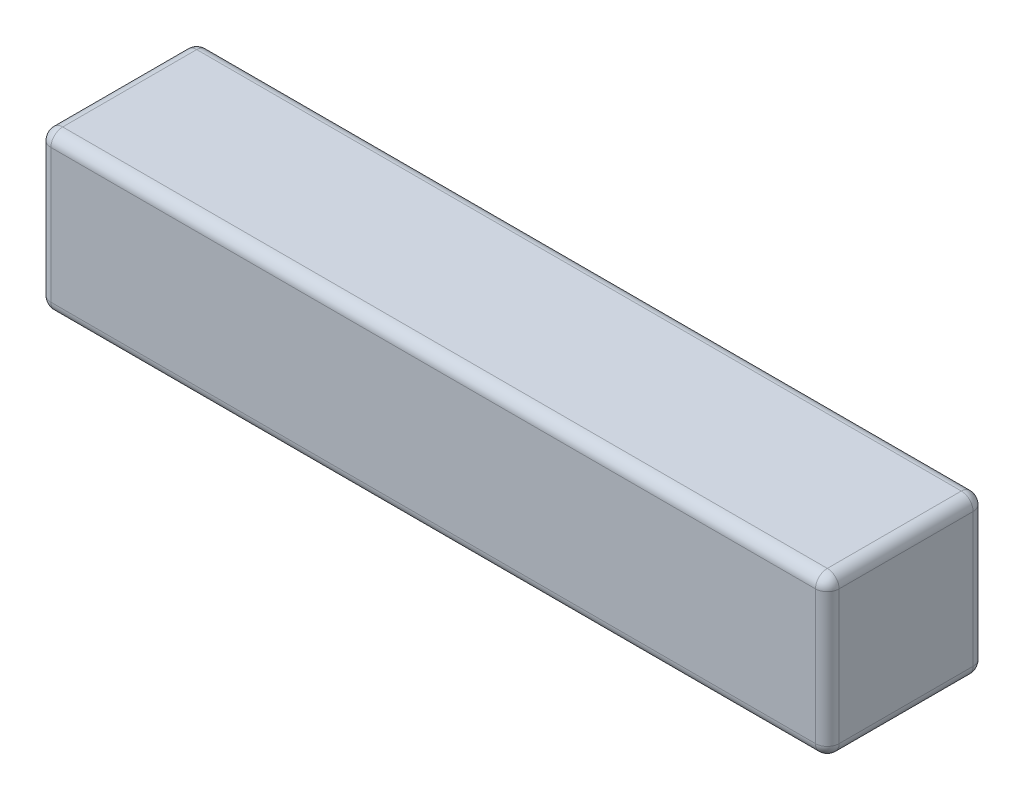
ISO-10303-21;
HEADER;
FILE_DESCRIPTION(('STEP AP214'),'2;1');
FILE_NAME('part.step','',(''),(''),'','','');
FILE_SCHEMA(('AUTOMOTIVE_DESIGN { 1 0 10303 214 1 1 1 1 }'));
ENDSEC;
DATA;
#1=APPLICATION_CONTEXT('core data for automotive mechanical design processes');
#2=APPLICATION_PROTOCOL_DEFINITION('international standard','automotive_design',2000,#1);
#3=PRODUCT_CONTEXT('',#1,'mechanical');
#4=PRODUCT('Part','Part','',(#3));
#5=PRODUCT_RELATED_PRODUCT_CATEGORY('part','',(#4));
#6=PRODUCT_DEFINITION_FORMATION('','',#4);
#7=PRODUCT_DEFINITION_CONTEXT('part definition',#1,'design');
#8=PRODUCT_DEFINITION('design','',#6,#7);
#9=PRODUCT_DEFINITION_SHAPE('','',#8);
#10=(LENGTH_UNIT() NAMED_UNIT(*) SI_UNIT(.MILLI.,.METRE.));
#11=(NAMED_UNIT(*) PLANE_ANGLE_UNIT() SI_UNIT($,.RADIAN.));
#12=(NAMED_UNIT(*) SI_UNIT($,.STERADIAN.) SOLID_ANGLE_UNIT());
#13=UNCERTAINTY_MEASURE_WITH_UNIT(LENGTH_MEASURE(1.E-05),#10,'distance_accuracy_value','');
#14=(GEOMETRIC_REPRESENTATION_CONTEXT(3) GLOBAL_UNCERTAINTY_ASSIGNED_CONTEXT((#13)) GLOBAL_UNIT_ASSIGNED_CONTEXT((#10,
#11,#12)) REPRESENTATION_CONTEXT('',''));
#15=CARTESIAN_POINT('',(0.,0.,0.));
#16=DIRECTION('',(0.,0.,1.));
#17=DIRECTION('',(1.,0.,0.));
#18=AXIS2_PLACEMENT_3D('',#15,#16,#17);
#19=CARTESIAN_POINT('',(4.,-0.15,-3.25423963133641));
#20=DIRECTION('',(-1.,0.,0.));
#21=DIRECTION('',(0.,0.,1.));
#22=AXIS2_PLACEMENT_3D('',#19,#20,#21);
#23=CYLINDRICAL_SURFACE('',#22,0.15);
#24=CARTESIAN_POINT('',(13.85,-0.15,-3.25423963133641));
#25=DIRECTION('',(-1.,0.,0.));
#26=DIRECTION('',(0.,0.,-1.));
#27=AXIS2_PLACEMENT_3D('',#24,#25,#26);
#28=CIRCLE('',#27,0.15);
#29=CARTESIAN_POINT('',(13.85,0.,-3.25423963133641));
#30=VERTEX_POINT('',#29);
#31=CARTESIAN_POINT('',(13.85,-0.15,-3.4042396313364));
#32=VERTEX_POINT('',#31);
#33=EDGE_CURVE('E25',#30,#32,#28,.T.);
#34=ORIENTED_EDGE('',*,*,#33,.T.);
#35=DIRECTION('',(1.,0.,0.));
#36=VECTOR('',#35,1.);
#37=CARTESIAN_POINT('',(14.,-0.15,-3.4042396313364));
#38=LINE('',#37,#36);
#39=CARTESIAN_POINT('',(4.15,-0.15,-3.4042396313364));
#40=VERTEX_POINT('',#39);
#41=EDGE_CURVE('E200',#40,#32,#38,.T.);
#42=ORIENTED_EDGE('',*,*,#41,.F.);
#43=CARTESIAN_POINT('',(4.15,-0.15,-3.25423963133641));
#44=DIRECTION('',(1.,0.,0.));
#45=DIRECTION('',(0.,0.,1.));
#46=AXIS2_PLACEMENT_3D('',#43,#44,#45);
#47=CIRCLE('',#46,0.15);
#48=CARTESIAN_POINT('',(4.15,0.,-3.25423963133641));
#49=VERTEX_POINT('',#48);
#50=EDGE_CURVE('E11',#40,#49,#47,.T.);
#51=ORIENTED_EDGE('',*,*,#50,.T.);
#52=DIRECTION('',(-1.,0.,0.));
#53=VECTOR('',#52,1.);
#54=CARTESIAN_POINT('',(4.,0.,-3.25423963133641));
#55=LINE('',#54,#53);
#56=EDGE_CURVE('E257',#30,#49,#55,.T.);
#57=ORIENTED_EDGE('',*,*,#56,.F.);
#58=EDGE_LOOP('',(#34,#42,#51,#57));
#59=FACE_BOUND('',#58,.T.);
#60=ADVANCED_FACE('F16',(#59),#23,.T.);
#61=CARTESIAN_POINT('',(4.15,-0.15,-3.25423963133641));
#62=DIRECTION('',(0.,1.,0.));
#63=DIRECTION('',(1.,0.,0.));
#64=AXIS2_PLACEMENT_3D('',#61,#62,#63);
#65=SPHERICAL_SURFACE('',#64,0.15);
#66=CARTESIAN_POINT('',(4.15,-0.15,-3.25423963133641));
#67=DIRECTION('',(0.,1.,0.));
#68=DIRECTION('',(0.,0.,1.));
#69=AXIS2_PLACEMENT_3D('',#66,#67,#68);
#70=CIRCLE('',#69,0.15);
#71=CARTESIAN_POINT('',(4.,-0.15,-3.25423963133641));
#72=VERTEX_POINT('',#71);
#73=EDGE_CURVE('E224',#40,#72,#70,.T.);
#74=ORIENTED_EDGE('',*,*,#73,.T.);
#75=CARTESIAN_POINT('',(4.15,-0.15,-3.25423963133641));
#76=DIRECTION('',(0.,0.,-1.));
#77=DIRECTION('',(-1.,0.,0.));
#78=AXIS2_PLACEMENT_3D('',#75,#76,#77);
#79=CIRCLE('',#78,0.15);
#80=EDGE_CURVE('E174',#72,#49,#79,.T.);
#81=ORIENTED_EDGE('',*,*,#80,.T.);
#82=ORIENTED_EDGE('',*,*,#50,.F.);
#83=EDGE_LOOP('',(#74,#81,#82));
#84=FACE_BOUND('',#83,.T.);
#85=ADVANCED_FACE('F18',(#84),#65,.T.);
#86=CARTESIAN_POINT('',(13.85,-0.15,-3.25423963133641));
#87=DIRECTION('',(0.,1.,0.));
#88=DIRECTION('',(1.,0.,0.));
#89=AXIS2_PLACEMENT_3D('',#86,#87,#88);
#90=SPHERICAL_SURFACE('',#89,0.15);
#91=CARTESIAN_POINT('',(13.85,-0.15,-3.25423963133641));
#92=DIRECTION('',(0.,0.,-1.));
#93=DIRECTION('',(-1.,0.,0.));
#94=AXIS2_PLACEMENT_3D('',#91,#92,#93);
#95=CIRCLE('',#94,0.15);
#96=CARTESIAN_POINT('',(14.,-0.15,-3.25423963133641));
#97=VERTEX_POINT('',#96);
#98=EDGE_CURVE('E194',#30,#97,#95,.T.);
#99=ORIENTED_EDGE('',*,*,#98,.T.);
#100=CARTESIAN_POINT('',(13.85,-0.15,-3.25423963133641));
#101=DIRECTION('',(0.,1.,0.));
#102=DIRECTION('',(0.,0.,1.));
#103=AXIS2_PLACEMENT_3D('',#100,#101,#102);
#104=CIRCLE('',#103,0.15);
#105=EDGE_CURVE('E189',#97,#32,#104,.T.);
#106=ORIENTED_EDGE('',*,*,#105,.T.);
#107=ORIENTED_EDGE('',*,*,#33,.F.);
#108=EDGE_LOOP('',(#99,#106,#107));
#109=FACE_BOUND('',#108,.T.);
#110=ADVANCED_FACE('F332',(#109),#90,.T.);
#111=CARTESIAN_POINT('',(4.15,-2.,-3.25423963133641));
#112=DIRECTION('',(0.,1.,0.));
#113=DIRECTION('',(0.,0.,1.));
#114=AXIS2_PLACEMENT_3D('',#111,#112,#113);
#115=CYLINDRICAL_SURFACE('',#114,0.15);
#116=CARTESIAN_POINT('',(4.15,-1.85,-3.25423963133641));
#117=DIRECTION('',(0.,1.,0.));
#118=DIRECTION('',(0.,0.,-1.));
#119=AXIS2_PLACEMENT_3D('',#116,#117,#118);
#120=CIRCLE('',#119,0.15);
#121=CARTESIAN_POINT('',(4.15,-1.85,-3.4042396313364));
#122=VERTEX_POINT('',#121);
#123=CARTESIAN_POINT('',(4.,-1.85,-3.25423963133641));
#124=VERTEX_POINT('',#123);
#125=EDGE_CURVE('E145',#122,#124,#120,.T.);
#126=ORIENTED_EDGE('',*,*,#125,.T.);
#127=DIRECTION('',(0.,-1.,0.));
#128=VECTOR('',#127,1.);
#129=CARTESIAN_POINT('',(4.,-2.,-3.25423963133641));
#130=LINE('',#129,#128);
#131=EDGE_CURVE('E176',#72,#124,#130,.T.);
#132=ORIENTED_EDGE('',*,*,#131,.F.);
#133=ORIENTED_EDGE('',*,*,#73,.F.);
#134=DIRECTION('',(0.,1.,0.));
#135=VECTOR('',#134,1.);
#136=CARTESIAN_POINT('',(4.15,-2.,-3.4042396313364));
#137=LINE('',#136,#135);
#138=EDGE_CURVE('E193',#122,#40,#137,.T.);
#139=ORIENTED_EDGE('',*,*,#138,.F.);
#140=EDGE_LOOP('',(#126,#132,#133,#139));
#141=FACE_BOUND('',#140,.T.);
#142=ADVANCED_FACE('F345',(#141),#115,.T.);
#143=CARTESIAN_POINT('',(4.15,-0.15,-1.4042396313364));
#144=DIRECTION('',(0.,0.,1.));
#145=DIRECTION('',(1.,0.,0.));
#146=AXIS2_PLACEMENT_3D('',#143,#144,#145);
#147=CYLINDRICAL_SURFACE('',#146,0.15);
#148=CARTESIAN_POINT('',(4.15,-0.15,-1.5542396313364));
#149=DIRECTION('',(0.,0.,-1.));
#150=DIRECTION('',(1.,0.,0.));
#151=AXIS2_PLACEMENT_3D('',#148,#149,#150);
#152=CIRCLE('',#151,0.15);
#153=CARTESIAN_POINT('',(4.,-0.15,-1.5542396313364));
#154=VERTEX_POINT('',#153);
#155=CARTESIAN_POINT('',(4.15,0.,-1.5542396313364));
#156=VERTEX_POINT('',#155);
#157=EDGE_CURVE('E36',#154,#156,#152,.T.);
#158=ORIENTED_EDGE('',*,*,#157,.T.);
#159=DIRECTION('',(0.,0.,1.));
#160=VECTOR('',#159,1.);
#161=CARTESIAN_POINT('',(4.15,0.,-1.4042396313364));
#162=LINE('',#161,#160);
#163=EDGE_CURVE('E262',#49,#156,#162,.T.);
#164=ORIENTED_EDGE('',*,*,#163,.F.);
#165=ORIENTED_EDGE('',*,*,#80,.F.);
#166=DIRECTION('',(0.,0.,-1.));
#167=VECTOR('',#166,1.);
#168=CARTESIAN_POINT('',(4.,-0.15,-3.4042396313364));
#169=LINE('',#168,#167);
#170=EDGE_CURVE('E164',#154,#72,#169,.T.);
#171=ORIENTED_EDGE('',*,*,#170,.F.);
#172=EDGE_LOOP('',(#158,#164,#165,#171));
#173=FACE_BOUND('',#172,.T.);
#174=ADVANCED_FACE('F172',(#173),#147,.T.);
#175=CARTESIAN_POINT('',(13.85,-0.15,-1.4042396313364));
#176=DIRECTION('',(0.,0.,-1.));
#177=DIRECTION('',(-1.,0.,0.));
#178=AXIS2_PLACEMENT_3D('',#175,#176,#177);
#179=CYLINDRICAL_SURFACE('',#178,0.15);
#180=CARTESIAN_POINT('',(13.85,-0.15,-1.5542396313364));
#181=DIRECTION('',(0.,0.,-1.));
#182=DIRECTION('',(1.,0.,0.));
#183=AXIS2_PLACEMENT_3D('',#180,#181,#182);
#184=CIRCLE('',#183,0.15);
#185=CARTESIAN_POINT('',(13.85,0.,-1.5542396313364));
#186=VERTEX_POINT('',#185);
#187=CARTESIAN_POINT('',(14.,-0.15,-1.5542396313364));
#188=VERTEX_POINT('',#187);
#189=EDGE_CURVE('E144',#186,#188,#184,.T.);
#190=ORIENTED_EDGE('',*,*,#189,.T.);
#191=DIRECTION('',(0.,0.,1.));
#192=VECTOR('',#191,1.);
#193=CARTESIAN_POINT('',(14.,-0.15,-1.4042396313364));
#194=LINE('',#193,#192);
#195=EDGE_CURVE('E187',#97,#188,#194,.T.);
#196=ORIENTED_EDGE('',*,*,#195,.F.);
#197=ORIENTED_EDGE('',*,*,#98,.F.);
#198=DIRECTION('',(0.,0.,-1.));
#199=VECTOR('',#198,1.);
#200=CARTESIAN_POINT('',(13.85,0.,-1.4042396313364));
#201=LINE('',#200,#199);
#202=EDGE_CURVE('E258',#186,#30,#201,.T.);
#203=ORIENTED_EDGE('',*,*,#202,.F.);
#204=EDGE_LOOP('',(#190,#196,#197,#203));
#205=FACE_BOUND('',#204,.T.);
#206=ADVANCED_FACE('F348',(#205),#179,.T.);
#207=CARTESIAN_POINT('',(13.85,-2.,-3.25423963133641));
#208=DIRECTION('',(0.,1.,0.));
#209=DIRECTION('',(0.,0.,1.));
#210=AXIS2_PLACEMENT_3D('',#207,#208,#209);
#211=CYLINDRICAL_SURFACE('',#210,0.15);
#212=CARTESIAN_POINT('',(13.85,-1.85,-3.25423963133641));
#213=DIRECTION('',(0.,1.,0.));
#214=DIRECTION('',(0.,0.,-1.));
#215=AXIS2_PLACEMENT_3D('',#212,#213,#214);
#216=CIRCLE('',#215,0.15);
#217=CARTESIAN_POINT('',(14.,-1.85,-3.25423963133641));
#218=VERTEX_POINT('',#217);
#219=CARTESIAN_POINT('',(13.85,-1.85,-3.4042396313364));
#220=VERTEX_POINT('',#219);
#221=EDGE_CURVE('E318',#218,#220,#216,.T.);
#222=ORIENTED_EDGE('',*,*,#221,.T.);
#223=DIRECTION('',(0.,-1.,0.));
#224=VECTOR('',#223,1.);
#225=CARTESIAN_POINT('',(13.85,-2.,-3.4042396313364));
#226=LINE('',#225,#224);
#227=EDGE_CURVE('E206',#32,#220,#226,.T.);
#228=ORIENTED_EDGE('',*,*,#227,.F.);
#229=ORIENTED_EDGE('',*,*,#105,.F.);
#230=DIRECTION('',(0.,1.,0.));
#231=VECTOR('',#230,1.);
#232=CARTESIAN_POINT('',(14.,-2.,-3.25423963133641));
#233=LINE('',#232,#231);
#234=EDGE_CURVE('E182',#218,#97,#233,.T.);
#235=ORIENTED_EDGE('',*,*,#234,.F.);
#236=EDGE_LOOP('',(#222,#228,#229,#235));
#237=FACE_BOUND('',#236,.T.);
#238=ADVANCED_FACE('F333',(#237),#211,.T.);
#239=CARTESIAN_POINT('',(4.15,-1.85,-3.25423963133641));
#240=DIRECTION('',(0.,1.,0.));
#241=DIRECTION('',(1.,0.,0.));
#242=AXIS2_PLACEMENT_3D('',#239,#240,#241);
#243=SPHERICAL_SURFACE('',#242,0.15);
#244=CARTESIAN_POINT('',(4.15,-1.85,-3.25423963133641));
#245=DIRECTION('',(-1.,0.,0.));
#246=DIRECTION('',(0.,-1.,0.));
#247=AXIS2_PLACEMENT_3D('',#244,#245,#246);
#248=CIRCLE('',#247,0.15);
#249=CARTESIAN_POINT('',(4.15,-2.,-3.25423963133641));
#250=VERTEX_POINT('',#249);
#251=EDGE_CURVE('E312',#122,#250,#248,.T.);
#252=ORIENTED_EDGE('',*,*,#251,.T.);
#253=CARTESIAN_POINT('',(4.15,-1.85,-3.25423963133641));
#254=DIRECTION('',(0.,0.,-1.));
#255=DIRECTION('',(-1.,0.,0.));
#256=AXIS2_PLACEMENT_3D('',#253,#254,#255);
#257=CIRCLE('',#256,0.15);
#258=EDGE_CURVE('E158',#250,#124,#257,.T.);
#259=ORIENTED_EDGE('',*,*,#258,.T.);
#260=ORIENTED_EDGE('',*,*,#125,.F.);
#261=EDGE_LOOP('',(#252,#259,#260));
#262=FACE_BOUND('',#261,.T.);
#263=ADVANCED_FACE('F364',(#262),#243,.T.);
#264=CARTESIAN_POINT('',(4.15,-0.15,-1.5542396313364));
#265=DIRECTION('',(0.,1.,0.));
#266=DIRECTION('',(1.,0.,0.));
#267=AXIS2_PLACEMENT_3D('',#264,#265,#266);
#268=SPHERICAL_SURFACE('',#267,0.15);
#269=CARTESIAN_POINT('',(4.15,-0.15,-1.5542396313364));
#270=DIRECTION('',(0.,1.,0.));
#271=DIRECTION('',(0.,0.,1.));
#272=AXIS2_PLACEMENT_3D('',#269,#270,#271);
#273=CIRCLE('',#272,0.15);
#274=CARTESIAN_POINT('',(4.15,-0.15,-1.4042396313364));
#275=VERTEX_POINT('',#274);
#276=EDGE_CURVE('E136',#154,#275,#273,.T.);
#277=ORIENTED_EDGE('',*,*,#276,.T.);
#278=CARTESIAN_POINT('',(4.15,-0.15,-1.5542396313364));
#279=DIRECTION('',(-1.,0.,0.));
#280=DIRECTION('',(0.,0.,1.));
#281=AXIS2_PLACEMENT_3D('',#278,#279,#280);
#282=CIRCLE('',#281,0.15);
#283=EDGE_CURVE('E143',#275,#156,#282,.T.);
#284=ORIENTED_EDGE('',*,*,#283,.T.);
#285=ORIENTED_EDGE('',*,*,#157,.F.);
#286=EDGE_LOOP('',(#277,#284,#285));
#287=FACE_BOUND('',#286,.T.);
#288=ADVANCED_FACE('F139',(#287),#268,.T.);
#289=CARTESIAN_POINT('',(13.85,-0.15,-1.5542396313364));
#290=DIRECTION('',(0.,1.,0.));
#291=DIRECTION('',(1.,0.,0.));
#292=AXIS2_PLACEMENT_3D('',#289,#290,#291);
#293=SPHERICAL_SURFACE('',#292,0.15);
#294=CARTESIAN_POINT('',(13.85,-0.15,-1.5542396313364));
#295=DIRECTION('',(1.,0.,0.));
#296=DIRECTION('',(0.,0.,-1.));
#297=AXIS2_PLACEMENT_3D('',#294,#295,#296);
#298=CIRCLE('',#297,0.15);
#299=CARTESIAN_POINT('',(13.85,-0.15,-1.4042396313364));
#300=VERTEX_POINT('',#299);
#301=EDGE_CURVE('E157',#186,#300,#298,.T.);
#302=ORIENTED_EDGE('',*,*,#301,.T.);
#303=CARTESIAN_POINT('',(13.85,-0.15,-1.5542396313364));
#304=DIRECTION('',(0.,1.,0.));
#305=DIRECTION('',(0.,0.,1.));
#306=AXIS2_PLACEMENT_3D('',#303,#304,#305);
#307=CIRCLE('',#306,0.15);
#308=EDGE_CURVE('E299',#300,#188,#307,.T.);
#309=ORIENTED_EDGE('',*,*,#308,.T.);
#310=ORIENTED_EDGE('',*,*,#189,.F.);
#311=EDGE_LOOP('',(#302,#309,#310));
#312=FACE_BOUND('',#311,.T.);
#313=ADVANCED_FACE('F405',(#312),#293,.T.);
#314=CARTESIAN_POINT('',(13.85,-1.85,-3.25423963133641));
#315=DIRECTION('',(0.,1.,0.));
#316=DIRECTION('',(1.,0.,0.));
#317=AXIS2_PLACEMENT_3D('',#314,#315,#316);
#318=SPHERICAL_SURFACE('',#317,0.15);
#319=CARTESIAN_POINT('',(13.85,-1.85,-3.25423963133641));
#320=DIRECTION('',(0.,0.,-1.));
#321=DIRECTION('',(-1.,0.,0.));
#322=AXIS2_PLACEMENT_3D('',#319,#320,#321);
#323=CIRCLE('',#322,0.15);
#324=CARTESIAN_POINT('',(13.85,-2.,-3.25423963133641));
#325=VERTEX_POINT('',#324);
#326=EDGE_CURVE('E296',#218,#325,#323,.T.);
#327=ORIENTED_EDGE('',*,*,#326,.T.);
#328=CARTESIAN_POINT('',(13.85,-1.85,-3.25423963133641));
#329=DIRECTION('',(1.,0.,0.));
#330=DIRECTION('',(0.,0.,-1.));
#331=AXIS2_PLACEMENT_3D('',#328,#329,#330);
#332=CIRCLE('',#331,0.15);
#333=EDGE_CURVE('E313',#325,#220,#332,.T.);
#334=ORIENTED_EDGE('',*,*,#333,.T.);
#335=ORIENTED_EDGE('',*,*,#221,.F.);
#336=EDGE_LOOP('',(#327,#334,#335));
#337=FACE_BOUND('',#336,.T.);
#338=ADVANCED_FACE('F359',(#337),#318,.T.);
#339=CARTESIAN_POINT('',(14.,-1.85,-3.25423963133641));
#340=DIRECTION('',(1.,0.,0.));
#341=DIRECTION('',(0.,0.,-1.));
#342=AXIS2_PLACEMENT_3D('',#339,#340,#341);
#343=CYLINDRICAL_SURFACE('',#342,0.15);
#344=ORIENTED_EDGE('',*,*,#333,.F.);
#345=DIRECTION('',(1.,0.,0.));
#346=VECTOR('',#345,1.);
#347=CARTESIAN_POINT('',(14.,-2.,-3.25423963133641));
#348=LINE('',#347,#346);
#349=EDGE_CURVE('E242',#250,#325,#348,.T.);
#350=ORIENTED_EDGE('',*,*,#349,.F.);
#351=ORIENTED_EDGE('',*,*,#251,.F.);
#352=DIRECTION('',(-1.,0.,0.));
#353=VECTOR('',#352,1.);
#354=CARTESIAN_POINT('',(4.,-1.85,-3.4042396313364));
#355=LINE('',#354,#353);
#356=EDGE_CURVE('E240',#220,#122,#355,.T.);
#357=ORIENTED_EDGE('',*,*,#356,.F.);
#358=EDGE_LOOP('',(#344,#350,#351,#357));
#359=FACE_BOUND('',#358,.T.);
#360=ADVANCED_FACE('F362',(#359),#343,.T.);
#361=CARTESIAN_POINT('',(4.15,-1.85,-3.4042396313364));
#362=DIRECTION('',(0.,0.,-1.));
#363=DIRECTION('',(-1.,0.,0.));
#364=AXIS2_PLACEMENT_3D('',#361,#362,#363);
#365=CYLINDRICAL_SURFACE('',#364,0.15);
#366=CARTESIAN_POINT('',(4.15,-1.85,-1.5542396313364));
#367=DIRECTION('',(0.,0.,-1.));
#368=DIRECTION('',(1.,0.,0.));
#369=AXIS2_PLACEMENT_3D('',#366,#367,#368);
#370=CIRCLE('',#369,0.15);
#371=CARTESIAN_POINT('',(4.15,-2.,-1.5542396313364));
#372=VERTEX_POINT('',#371);
#373=CARTESIAN_POINT('',(4.,-1.85,-1.5542396313364));
#374=VERTEX_POINT('',#373);
#375=EDGE_CURVE('E276',#372,#374,#370,.T.);
#376=ORIENTED_EDGE('',*,*,#375,.T.);
#377=DIRECTION('',(0.,0.,1.));
#378=VECTOR('',#377,1.);
#379=CARTESIAN_POINT('',(4.,-1.85,-1.4042396313364));
#380=LINE('',#379,#378);
#381=EDGE_CURVE('E170',#124,#374,#380,.T.);
#382=ORIENTED_EDGE('',*,*,#381,.F.);
#383=ORIENTED_EDGE('',*,*,#258,.F.);
#384=DIRECTION('',(0.,0.,-1.));
#385=VECTOR('',#384,1.);
#386=CARTESIAN_POINT('',(4.15,-2.,-3.4042396313364));
#387=LINE('',#386,#385);
#388=EDGE_CURVE('E239',#372,#250,#387,.T.);
#389=ORIENTED_EDGE('',*,*,#388,.F.);
#390=EDGE_LOOP('',(#376,#382,#383,#389));
#391=FACE_BOUND('',#390,.T.);
#392=ADVANCED_FACE('F366',(#391),#365,.T.);
#393=CARTESIAN_POINT('',(4.15,-2.,-1.5542396313364));
#394=DIRECTION('',(0.,1.,0.));
#395=DIRECTION('',(0.,0.,1.));
#396=AXIS2_PLACEMENT_3D('',#393,#394,#395);
#397=CYLINDRICAL_SURFACE('',#396,0.15);
#398=CARTESIAN_POINT('',(4.15,-1.85,-1.5542396313364));
#399=DIRECTION('',(0.,1.,0.));
#400=DIRECTION('',(0.,0.,-1.));
#401=AXIS2_PLACEMENT_3D('',#398,#399,#400);
#402=CIRCLE('',#401,0.15);
#403=CARTESIAN_POINT('',(4.15,-1.85,-1.4042396313364));
#404=VERTEX_POINT('',#403);
#405=EDGE_CURVE('E284',#374,#404,#402,.T.);
#406=ORIENTED_EDGE('',*,*,#405,.T.);
#407=DIRECTION('',(0.,-1.,0.));
#408=VECTOR('',#407,1.);
#409=CARTESIAN_POINT('',(4.15,-2.,-1.4042396313364));
#410=LINE('',#409,#408);
#411=EDGE_CURVE('E154',#275,#404,#410,.T.);
#412=ORIENTED_EDGE('',*,*,#411,.F.);
#413=ORIENTED_EDGE('',*,*,#276,.F.);
#414=DIRECTION('',(0.,1.,0.));
#415=VECTOR('',#414,1.);
#416=CARTESIAN_POINT('',(4.,-2.,-1.5542396313364));
#417=LINE('',#416,#415);
#418=EDGE_CURVE('E155',#374,#154,#417,.T.);
#419=ORIENTED_EDGE('',*,*,#418,.F.);
#420=EDGE_LOOP('',(#406,#412,#413,#419));
#421=FACE_BOUND('',#420,.T.);
#422=ADVANCED_FACE('F151',(#421),#397,.T.);
#423=CARTESIAN_POINT('',(4.,-0.15,-1.5542396313364));
#424=DIRECTION('',(1.,0.,0.));
#425=DIRECTION('',(0.,0.,-1.));
#426=AXIS2_PLACEMENT_3D('',#423,#424,#425);
#427=CYLINDRICAL_SURFACE('',#426,0.15);
#428=ORIENTED_EDGE('',*,*,#283,.F.);
#429=DIRECTION('',(-1.,0.,0.));
#430=VECTOR('',#429,1.);
#431=CARTESIAN_POINT('',(4.,-0.15,-1.4042396313364));
#432=LINE('',#431,#430);
#433=EDGE_CURVE('E209',#300,#275,#432,.T.);
#434=ORIENTED_EDGE('',*,*,#433,.F.);
#435=ORIENTED_EDGE('',*,*,#301,.F.);
#436=DIRECTION('',(1.,0.,0.));
#437=VECTOR('',#436,1.);
#438=CARTESIAN_POINT('',(4.,0.,-1.5542396313364));
#439=LINE('',#438,#437);
#440=EDGE_CURVE('E268',#156,#186,#439,.T.);
#441=ORIENTED_EDGE('',*,*,#440,.F.);
#442=EDGE_LOOP('',(#428,#434,#435,#441));
#443=FACE_BOUND('',#442,.T.);
#444=ADVANCED_FACE('F486',(#443),#427,.T.);
#445=CARTESIAN_POINT('',(13.85,-2.,-1.5542396313364));
#446=DIRECTION('',(0.,1.,0.));
#447=DIRECTION('',(0.,0.,1.));
#448=AXIS2_PLACEMENT_3D('',#445,#446,#447);
#449=CYLINDRICAL_SURFACE('',#448,0.15);
#450=CARTESIAN_POINT('',(13.85,-1.85,-1.5542396313364));
#451=DIRECTION('',(0.,1.,0.));
#452=DIRECTION('',(0.,0.,-1.));
#453=AXIS2_PLACEMENT_3D('',#450,#451,#452);
#454=CIRCLE('',#453,0.15);
#455=CARTESIAN_POINT('',(13.85,-1.85,-1.4042396313364));
#456=VERTEX_POINT('',#455);
#457=CARTESIAN_POINT('',(14.,-1.85,-1.5542396313364));
#458=VERTEX_POINT('',#457);
#459=EDGE_CURVE('E287',#456,#458,#454,.T.);
#460=ORIENTED_EDGE('',*,*,#459,.T.);
#461=DIRECTION('',(0.,-1.,0.));
#462=VECTOR('',#461,1.);
#463=CARTESIAN_POINT('',(14.,-2.,-1.5542396313364));
#464=LINE('',#463,#462);
#465=EDGE_CURVE('E199',#188,#458,#464,.T.);
#466=ORIENTED_EDGE('',*,*,#465,.F.);
#467=ORIENTED_EDGE('',*,*,#308,.F.);
#468=DIRECTION('',(0.,1.,0.));
#469=VECTOR('',#468,1.);
#470=CARTESIAN_POINT('',(13.85,-2.,-1.4042396313364));
#471=LINE('',#470,#469);
#472=EDGE_CURVE('E166',#456,#300,#471,.T.);
#473=ORIENTED_EDGE('',*,*,#472,.F.);
#474=EDGE_LOOP('',(#460,#466,#467,#473));
#475=FACE_BOUND('',#474,.T.);
#476=ADVANCED_FACE('F493',(#475),#449,.T.);
#477=CARTESIAN_POINT('',(13.85,-1.85,-1.4042396313364));
#478=DIRECTION('',(0.,0.,1.));
#479=DIRECTION('',(1.,0.,0.));
#480=AXIS2_PLACEMENT_3D('',#477,#478,#479);
#481=CYLINDRICAL_SURFACE('',#480,0.15);
#482=CARTESIAN_POINT('',(13.85,-1.85,-1.5542396313364));
#483=DIRECTION('',(0.,0.,-1.));
#484=DIRECTION('',(1.,0.,0.));
#485=AXIS2_PLACEMENT_3D('',#482,#483,#484);
#486=CIRCLE('',#485,0.15);
#487=CARTESIAN_POINT('',(13.85,-2.,-1.5542396313364));
#488=VERTEX_POINT('',#487);
#489=EDGE_CURVE('E283',#458,#488,#486,.T.);
#490=ORIENTED_EDGE('',*,*,#489,.T.);
#491=DIRECTION('',(0.,0.,1.));
#492=VECTOR('',#491,1.);
#493=CARTESIAN_POINT('',(13.85,-2.,-1.4042396313364));
#494=LINE('',#493,#492);
#495=EDGE_CURVE('E249',#325,#488,#494,.T.);
#496=ORIENTED_EDGE('',*,*,#495,.F.);
#497=ORIENTED_EDGE('',*,*,#326,.F.);
#498=DIRECTION('',(0.,0.,-1.));
#499=VECTOR('',#498,1.);
#500=CARTESIAN_POINT('',(14.,-1.85,-3.4042396313364));
#501=LINE('',#500,#499);
#502=EDGE_CURVE('E188',#458,#218,#501,.T.);
#503=ORIENTED_EDGE('',*,*,#502,.F.);
#504=EDGE_LOOP('',(#490,#496,#497,#503));
#505=FACE_BOUND('',#504,.T.);
#506=ADVANCED_FACE('F354',(#505),#481,.T.);
#507=CARTESIAN_POINT('',(4.15,-1.85,-1.5542396313364));
#508=DIRECTION('',(0.,1.,0.));
#509=DIRECTION('',(1.,0.,0.));
#510=AXIS2_PLACEMENT_3D('',#507,#508,#509);
#511=SPHERICAL_SURFACE('',#510,0.15);
#512=ORIENTED_EDGE('',*,*,#375,.F.);
#513=CARTESIAN_POINT('',(4.15,-1.85,-1.5542396313364));
#514=DIRECTION('',(-1.,0.,0.));
#515=DIRECTION('',(0.,0.,1.));
#516=AXIS2_PLACEMENT_3D('',#513,#514,#515);
#517=CIRCLE('',#516,0.15);
#518=EDGE_CURVE('E277',#372,#404,#517,.T.);
#519=ORIENTED_EDGE('',*,*,#518,.T.);
#520=ORIENTED_EDGE('',*,*,#405,.F.);
#521=EDGE_LOOP('',(#512,#519,#520));
#522=FACE_BOUND('',#521,.T.);
#523=ADVANCED_FACE('F371',(#522),#511,.T.);
#524=CARTESIAN_POINT('',(13.85,-1.85,-1.5542396313364));
#525=DIRECTION('',(0.,1.,0.));
#526=DIRECTION('',(1.,0.,0.));
#527=AXIS2_PLACEMENT_3D('',#524,#525,#526);
#528=SPHERICAL_SURFACE('',#527,0.15);
#529=ORIENTED_EDGE('',*,*,#459,.F.);
#530=CARTESIAN_POINT('',(13.85,-1.85,-1.5542396313364));
#531=DIRECTION('',(1.,0.,0.));
#532=DIRECTION('',(0.,0.,-1.));
#533=AXIS2_PLACEMENT_3D('',#530,#531,#532);
#534=CIRCLE('',#533,0.15);
#535=EDGE_CURVE('E275',#456,#488,#534,.T.);
#536=ORIENTED_EDGE('',*,*,#535,.T.);
#537=ORIENTED_EDGE('',*,*,#489,.F.);
#538=EDGE_LOOP('',(#529,#536,#537));
#539=FACE_BOUND('',#538,.T.);
#540=ADVANCED_FACE('F520',(#539),#528,.T.);
#541=CARTESIAN_POINT('',(4.,-1.85,-1.5542396313364));
#542=DIRECTION('',(-1.,0.,0.));
#543=DIRECTION('',(0.,0.,1.));
#544=AXIS2_PLACEMENT_3D('',#541,#542,#543);
#545=CYLINDRICAL_SURFACE('',#544,0.15);
#546=ORIENTED_EDGE('',*,*,#535,.F.);
#547=DIRECTION('',(1.,0.,0.));
#548=VECTOR('',#547,1.);
#549=CARTESIAN_POINT('',(14.,-1.85,-1.4042396313364));
#550=LINE('',#549,#548);
#551=EDGE_CURVE('E220',#404,#456,#550,.T.);
#552=ORIENTED_EDGE('',*,*,#551,.F.);
#553=ORIENTED_EDGE('',*,*,#518,.F.);
#554=DIRECTION('',(-1.,0.,0.));
#555=VECTOR('',#554,1.);
#556=CARTESIAN_POINT('',(4.,-2.,-1.5542396313364));
#557=LINE('',#556,#555);
#558=EDGE_CURVE('E252',#488,#372,#557,.T.);
#559=ORIENTED_EDGE('',*,*,#558,.F.);
#560=EDGE_LOOP('',(#546,#552,#553,#559));
#561=FACE_BOUND('',#560,.T.);
#562=ADVANCED_FACE('F376',(#561),#545,.T.);
#563=CARTESIAN_POINT('',(4.,0.,-1.4042396313364));
#564=DIRECTION('',(0.,1.,0.));
#565=DIRECTION('',(1.,0.,0.));
#566=AXIS2_PLACEMENT_3D('',#563,#564,#565);
#567=PLANE('',#566);
#568=ORIENTED_EDGE('',*,*,#202,.T.);
#569=ORIENTED_EDGE('',*,*,#56,.T.);
#570=ORIENTED_EDGE('',*,*,#163,.T.);
#571=ORIENTED_EDGE('',*,*,#440,.T.);
#572=EDGE_LOOP('',(#568,#569,#570,#571));
#573=FACE_BOUND('',#572,.T.);
#574=ADVANCED_FACE('F344',(#573),#567,.T.);
#575=CARTESIAN_POINT('',(4.,-2.,-1.4042396313364));
#576=DIRECTION('',(0.,1.,0.));
#577=DIRECTION('',(1.,0.,0.));
#578=AXIS2_PLACEMENT_3D('',#575,#576,#577);
#579=PLANE('',#578);
#580=ORIENTED_EDGE('',*,*,#388,.T.);
#581=ORIENTED_EDGE('',*,*,#349,.T.);
#582=ORIENTED_EDGE('',*,*,#495,.T.);
#583=ORIENTED_EDGE('',*,*,#558,.T.);
#584=EDGE_LOOP('',(#580,#581,#582,#583));
#585=FACE_BOUND('',#584,.T.);
#586=ADVANCED_FACE('F378',(#585),#579,.F.);
#587=CARTESIAN_POINT('',(14.,-2.,-3.4042396313364));
#588=DIRECTION('',(0.,0.,-1.));
#589=DIRECTION('',(0.,-1.,0.));
#590=AXIS2_PLACEMENT_3D('',#587,#588,#589);
#591=PLANE('',#590);
#592=ORIENTED_EDGE('',*,*,#138,.T.);
#593=ORIENTED_EDGE('',*,*,#41,.T.);
#594=ORIENTED_EDGE('',*,*,#227,.T.);
#595=ORIENTED_EDGE('',*,*,#356,.T.);
#596=EDGE_LOOP('',(#592,#593,#594,#595));
#597=FACE_BOUND('',#596,.T.);
#598=ADVANCED_FACE('F337',(#597),#591,.T.);
#599=CARTESIAN_POINT('',(14.,-2.,-1.4042396313364));
#600=DIRECTION('',(1.,0.,0.));
#601=DIRECTION('',(0.,1.,0.));
#602=AXIS2_PLACEMENT_3D('',#599,#600,#601);
#603=PLANE('',#602);
#604=ORIENTED_EDGE('',*,*,#502,.T.);
#605=ORIENTED_EDGE('',*,*,#234,.T.);
#606=ORIENTED_EDGE('',*,*,#195,.T.);
#607=ORIENTED_EDGE('',*,*,#465,.T.);
#608=EDGE_LOOP('',(#604,#605,#606,#607));
#609=FACE_BOUND('',#608,.T.);
#610=ADVANCED_FACE('F349',(#609),#603,.T.);
#611=CARTESIAN_POINT('',(4.,-2.,-1.4042396313364));
#612=DIRECTION('',(0.,0.,1.));
#613=DIRECTION('',(1.,0.,0.));
#614=AXIS2_PLACEMENT_3D('',#611,#612,#613);
#615=PLANE('',#614);
#616=ORIENTED_EDGE('',*,*,#472,.T.);
#617=ORIENTED_EDGE('',*,*,#433,.T.);
#618=ORIENTED_EDGE('',*,*,#411,.T.);
#619=ORIENTED_EDGE('',*,*,#551,.T.);
#620=EDGE_LOOP('',(#616,#617,#618,#619));
#621=FACE_BOUND('',#620,.T.);
#622=ADVANCED_FACE('F660',(#621),#615,.T.);
#623=CARTESIAN_POINT('',(4.,-2.,-3.4042396313364));
#624=DIRECTION('',(-1.,0.,0.));
#625=DIRECTION('',(0.,0.,1.));
#626=AXIS2_PLACEMENT_3D('',#623,#624,#625);
#627=PLANE('',#626);
#628=ORIENTED_EDGE('',*,*,#170,.T.);
#629=ORIENTED_EDGE('',*,*,#131,.T.);
#630=ORIENTED_EDGE('',*,*,#381,.T.);
#631=ORIENTED_EDGE('',*,*,#418,.T.);
#632=EDGE_LOOP('',(#628,#629,#630,#631));
#633=FACE_BOUND('',#632,.T.);
#634=ADVANCED_FACE('F162',(#633),#627,.T.);
#635=CLOSED_SHELL('',(#60,#85,#110,#142,#174,#206,#238,#263,#288,#313,#338,#360,#392,#422,#444,
#476,#506,#523,#540,#562,#574,#586,#598,#610,#622,#634));
#636=MANIFOLD_SOLID_BREP('B1',#635);
#637=ADVANCED_BREP_SHAPE_REPRESENTATION('',(#18,#636),#14);
#638=SHAPE_DEFINITION_REPRESENTATION(#9,#637);
ENDSEC;
END-ISO-10303-21;
